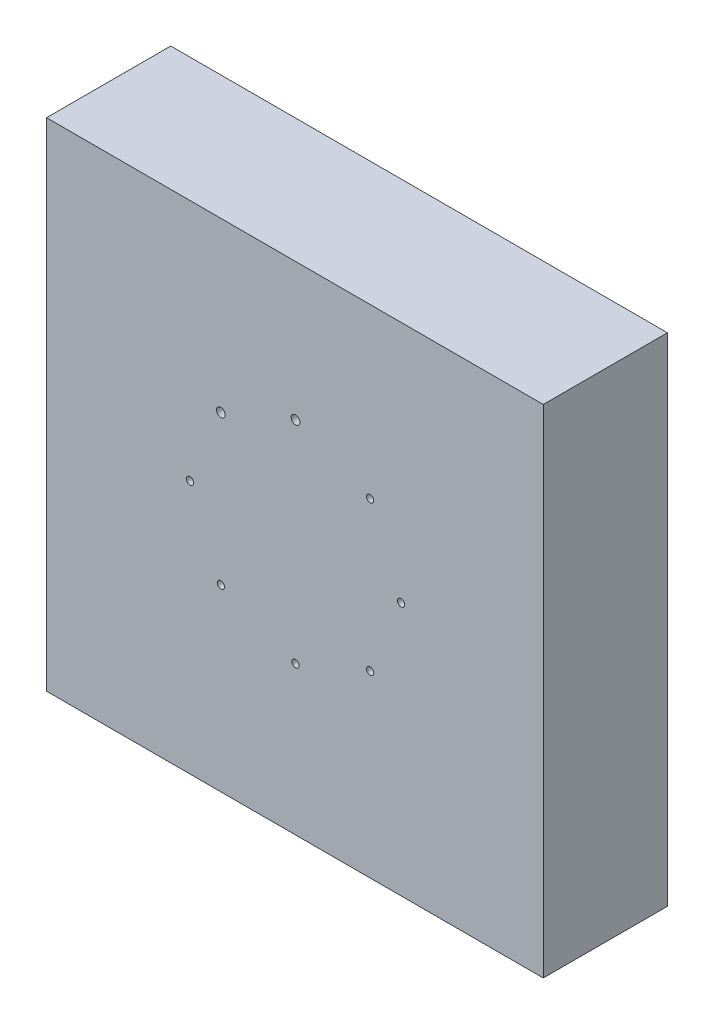
ISO-10303-21;
HEADER;
FILE_DESCRIPTION(('STEP AP214'),'2;1');
FILE_NAME('part.step','',(''),(''),'','','');
FILE_SCHEMA(('AUTOMOTIVE_DESIGN { 1 0 10303 214 1 1 1 1 }'));
ENDSEC;
DATA;
#1=APPLICATION_CONTEXT('core data for automotive mechanical design processes');
#2=APPLICATION_PROTOCOL_DEFINITION('international standard','automotive_design',2000,#1);
#3=PRODUCT_CONTEXT('',#1,'mechanical');
#4=PRODUCT('Part','Part','',(#3));
#5=PRODUCT_RELATED_PRODUCT_CATEGORY('part','',(#4));
#6=PRODUCT_DEFINITION_FORMATION('','',#4);
#7=PRODUCT_DEFINITION_CONTEXT('part definition',#1,'design');
#8=PRODUCT_DEFINITION('design','',#6,#7);
#9=PRODUCT_DEFINITION_SHAPE('','',#8);
#10=(LENGTH_UNIT() NAMED_UNIT(*) SI_UNIT(.MILLI.,.METRE.));
#11=(NAMED_UNIT(*) PLANE_ANGLE_UNIT() SI_UNIT($,.RADIAN.));
#12=(NAMED_UNIT(*) SI_UNIT($,.STERADIAN.) SOLID_ANGLE_UNIT());
#13=UNCERTAINTY_MEASURE_WITH_UNIT(LENGTH_MEASURE(1.E-05),#10,'distance_accuracy_value','');
#14=(GEOMETRIC_REPRESENTATION_CONTEXT(3) GLOBAL_UNCERTAINTY_ASSIGNED_CONTEXT((#13)) GLOBAL_UNIT_ASSIGNED_CONTEXT((#10,
#11,#12)) REPRESENTATION_CONTEXT('',''));
#15=CARTESIAN_POINT('',(0.,0.,0.));
#16=DIRECTION('',(0.,0.,1.));
#17=DIRECTION('',(1.,0.,0.));
#18=AXIS2_PLACEMENT_3D('',#15,#16,#17);
#19=CARTESIAN_POINT('',(100.,-100.,50.));
#20=DIRECTION('',(-1.,0.,0.));
#21=DIRECTION('',(0.,0.,1.));
#22=AXIS2_PLACEMENT_3D('',#19,#20,#21);
#23=PLANE('',#22);
#24=DIRECTION('',(0.,1.,0.));
#25=VECTOR('',#24,1.);
#26=CARTESIAN_POINT('',(100.,-100.,0.));
#27=LINE('',#26,#25);
#28=CARTESIAN_POINT('',(100.,-100.,0.));
#29=VERTEX_POINT('',#28);
#30=CARTESIAN_POINT('',(100.,100.,0.));
#31=VERTEX_POINT('',#30);
#32=EDGE_CURVE('E113',#29,#31,#27,.T.);
#33=ORIENTED_EDGE('',*,*,#32,.T.);
#34=DIRECTION('',(0.,0.,-1.));
#35=VECTOR('',#34,1.);
#36=CARTESIAN_POINT('',(100.,100.,50.));
#37=LINE('',#36,#35);
#38=CARTESIAN_POINT('',(100.,100.,50.));
#39=VERTEX_POINT('',#38);
#40=EDGE_CURVE('E12',#39,#31,#37,.T.);
#41=ORIENTED_EDGE('',*,*,#40,.F.);
#42=DIRECTION('',(0.,1.,0.));
#43=VECTOR('',#42,1.);
#44=CARTESIAN_POINT('',(100.,-100.,50.));
#45=LINE('',#44,#43);
#46=CARTESIAN_POINT('',(100.,-100.,50.));
#47=VERTEX_POINT('',#46);
#48=EDGE_CURVE('E101',#47,#39,#45,.T.);
#49=ORIENTED_EDGE('',*,*,#48,.F.);
#50=DIRECTION('',(0.,0.,-1.));
#51=VECTOR('',#50,1.);
#52=CARTESIAN_POINT('',(100.,-100.,50.));
#53=LINE('',#52,#51);
#54=EDGE_CURVE('E109',#47,#29,#53,.T.);
#55=ORIENTED_EDGE('',*,*,#54,.T.);
#56=EDGE_LOOP('',(#33,#41,#49,#55));
#57=FACE_BOUND('',#56,.T.);
#58=ADVANCED_FACE('F50',(#57),#23,.F.);
#59=CARTESIAN_POINT('',(-100.,100.,50.));
#60=DIRECTION('',(0.,-1.,0.));
#61=DIRECTION('',(0.,0.,-1.));
#62=AXIS2_PLACEMENT_3D('',#59,#60,#61);
#63=PLANE('',#62);
#64=DIRECTION('',(-1.,0.,0.));
#65=VECTOR('',#64,1.);
#66=CARTESIAN_POINT('',(-100.,100.,0.));
#67=LINE('',#66,#65);
#68=CARTESIAN_POINT('',(-100.,100.,0.));
#69=VERTEX_POINT('',#68);
#70=EDGE_CURVE('E105',#31,#69,#67,.T.);
#71=ORIENTED_EDGE('',*,*,#70,.T.);
#72=DIRECTION('',(0.,0.,-1.));
#73=VECTOR('',#72,1.);
#74=CARTESIAN_POINT('',(-100.,100.,50.));
#75=LINE('',#74,#73);
#76=CARTESIAN_POINT('',(-100.,100.,50.));
#77=VERTEX_POINT('',#76);
#78=EDGE_CURVE('E58',#77,#69,#75,.T.);
#79=ORIENTED_EDGE('',*,*,#78,.F.);
#80=DIRECTION('',(-1.,0.,0.));
#81=VECTOR('',#80,1.);
#82=CARTESIAN_POINT('',(-100.,100.,50.));
#83=LINE('',#82,#81);
#84=EDGE_CURVE('E96',#39,#77,#83,.T.);
#85=ORIENTED_EDGE('',*,*,#84,.F.);
#86=ORIENTED_EDGE('',*,*,#40,.T.);
#87=EDGE_LOOP('',(#71,#79,#85,#86));
#88=FACE_BOUND('',#87,.T.);
#89=ADVANCED_FACE('F104',(#88),#63,.F.);
#90=CARTESIAN_POINT('',(-100.,-100.,50.));
#91=DIRECTION('',(1.,0.,0.));
#92=DIRECTION('',(0.,0.,-1.));
#93=AXIS2_PLACEMENT_3D('',#90,#91,#92);
#94=PLANE('',#93);
#95=DIRECTION('',(0.,-1.,0.));
#96=VECTOR('',#95,1.);
#97=CARTESIAN_POINT('',(-100.,-100.,0.));
#98=LINE('',#97,#96);
#99=CARTESIAN_POINT('',(-100.,-100.,0.));
#100=VERTEX_POINT('',#99);
#101=EDGE_CURVE('E83',#69,#100,#98,.T.);
#102=ORIENTED_EDGE('',*,*,#101,.T.);
#103=DIRECTION('',(0.,0.,-1.));
#104=VECTOR('',#103,1.);
#105=CARTESIAN_POINT('',(-100.,-100.,50.));
#106=LINE('',#105,#104);
#107=CARTESIAN_POINT('',(-100.,-100.,50.));
#108=VERTEX_POINT('',#107);
#109=EDGE_CURVE('E106',#108,#100,#106,.T.);
#110=ORIENTED_EDGE('',*,*,#109,.F.);
#111=DIRECTION('',(0.,-1.,0.));
#112=VECTOR('',#111,1.);
#113=CARTESIAN_POINT('',(-100.,-100.,50.));
#114=LINE('',#113,#112);
#115=EDGE_CURVE('E99',#77,#108,#114,.T.);
#116=ORIENTED_EDGE('',*,*,#115,.F.);
#117=ORIENTED_EDGE('',*,*,#78,.T.);
#118=EDGE_LOOP('',(#102,#110,#116,#117));
#119=FACE_BOUND('',#118,.T.);
#120=ADVANCED_FACE('F107',(#119),#94,.F.);
#121=CARTESIAN_POINT('',(-100.,-100.,50.));
#122=DIRECTION('',(0.,1.,0.));
#123=DIRECTION('',(0.,0.,1.));
#124=AXIS2_PLACEMENT_3D('',#121,#122,#123);
#125=PLANE('',#124);
#126=DIRECTION('',(1.,0.,0.));
#127=VECTOR('',#126,1.);
#128=CARTESIAN_POINT('',(-100.,-100.,0.));
#129=LINE('',#128,#127);
#130=EDGE_CURVE('E89',#100,#29,#129,.T.);
#131=ORIENTED_EDGE('',*,*,#130,.T.);
#132=ORIENTED_EDGE('',*,*,#54,.F.);
#133=DIRECTION('',(1.,0.,0.));
#134=VECTOR('',#133,1.);
#135=CARTESIAN_POINT('',(-100.,-100.,50.));
#136=LINE('',#135,#134);
#137=EDGE_CURVE('E66',#108,#47,#136,.T.);
#138=ORIENTED_EDGE('',*,*,#137,.F.);
#139=ORIENTED_EDGE('',*,*,#109,.T.);
#140=EDGE_LOOP('',(#131,#132,#138,#139));
#141=FACE_BOUND('',#140,.T.);
#142=ADVANCED_FACE('F121',(#141),#125,.F.);
#143=CARTESIAN_POINT('',(0.,0.,50.));
#144=DIRECTION('',(0.,0.,-1.));
#145=DIRECTION('',(-1.,0.,0.));
#146=AXIS2_PLACEMENT_3D('',#143,#144,#145);
#147=PLANE('',#146);
#148=CARTESIAN_POINT('',(0.2500000000469,-40.2500000000434,50.));
#149=DIRECTION('',(0.,0.,1.));
#150=DIRECTION('',(1.,0.,0.));
#151=AXIS2_PLACEMENT_3D('',#148,#149,#150);
#152=CIRCLE('',#151,1.45000000000055);
#153=CARTESIAN_POINT('',(1.70000000004745,-40.2500000000434,50.));
#154=VERTEX_POINT('',#153);
#155=EDGE_CURVE('E140',#154,#154,#152,.T.);
#156=ORIENTED_EDGE('',*,*,#155,.F.);
#157=EDGE_LOOP('',(#156));
#158=FACE_BOUND('',#157,.T.);
#159=CARTESIAN_POINT('',(0.250543486024143,44.7499999982499,50.));
#160=DIRECTION('',(0.,0.,1.));
#161=DIRECTION('',(1.,0.,0.));
#162=AXIS2_PLACEMENT_3D('',#159,#160,#161);
#163=CIRCLE('',#162,1.75054348597008);
#164=CARTESIAN_POINT('',(2.00108697199422,44.7499999982499,50.));
#165=VERTEX_POINT('',#164);
#166=EDGE_CURVE('E156',#165,#165,#163,.T.);
#167=ORIENTED_EDGE('',*,*,#166,.F.);
#168=EDGE_LOOP('',(#167));
#169=FACE_BOUND('',#168,.T.);
#170=CARTESIAN_POINT('',(30.3020382005077,32.3020382004647,50.));
#171=DIRECTION('',(0.,0.,1.));
#172=DIRECTION('',(1.,0.,0.));
#173=AXIS2_PLACEMENT_3D('',#170,#171,#172);
#174=CIRCLE('',#173,1.43937026376093);
#175=CARTESIAN_POINT('',(31.7414084642686,32.3020382004647,50.));
#176=VERTEX_POINT('',#175);
#177=EDGE_CURVE('E162',#176,#176,#174,.T.);
#178=ORIENTED_EDGE('',*,*,#177,.F.);
#179=EDGE_LOOP('',(#178));
#180=FACE_BOUND('',#179,.T.);
#181=CARTESIAN_POINT('',(30.3021177915458,-27.8022303520025,50.));
#182=DIRECTION('',(0.,0.,1.));
#183=DIRECTION('',(1.,0.,0.));
#184=AXIS2_PLACEMENT_3D('',#181,#182,#183);
#185=CIRCLE('',#184,1.44999999999983);
#186=CARTESIAN_POINT('',(31.7521177915456,-27.8022303520025,50.));
#187=VERTEX_POINT('',#186);
#188=EDGE_CURVE('E145',#187,#187,#185,.T.);
#189=ORIENTED_EDGE('',*,*,#188,.F.);
#190=EDGE_LOOP('',(#189));
#191=FACE_BOUND('',#190,.T.);
#192=CARTESIAN_POINT('',(-29.8020382004144,-27.8020382004581,50.));
#193=DIRECTION('',(0.,0.,1.));
#194=DIRECTION('',(1.,0.,0.));
#195=AXIS2_PLACEMENT_3D('',#192,#193,#194);
#196=CIRCLE('',#195,1.45014707417167);
#197=CARTESIAN_POINT('',(-28.3518911262428,-27.8020382004581,50.));
#198=VERTEX_POINT('',#197);
#199=EDGE_CURVE('E137',#198,#198,#196,.T.);
#200=ORIENTED_EDGE('',*,*,#199,.F.);
#201=EDGE_LOOP('',(#200));
#202=FACE_BOUND('',#201,.T.);
#203=CARTESIAN_POINT('',(-42.2499999999999,2.25000000000322,50.));
#204=DIRECTION('',(0.,0.,1.));
#205=DIRECTION('',(1.,0.,0.));
#206=AXIS2_PLACEMENT_3D('',#203,#204,#205);
#207=CIRCLE('',#206,1.44961569738909);
#208=CARTESIAN_POINT('',(-40.8003843026108,2.25000000000322,50.));
#209=VERTEX_POINT('',#208);
#210=EDGE_CURVE('E130',#209,#209,#207,.T.);
#211=ORIENTED_EDGE('',*,*,#210,.F.);
#212=EDGE_LOOP('',(#211));
#213=FACE_BOUND('',#212,.T.);
#214=CARTESIAN_POINT('',(-29.8020382004149,32.3020382004641,50.));
#215=DIRECTION('',(0.,0.,1.));
#216=DIRECTION('',(1.,0.,0.));
#217=AXIS2_PLACEMENT_3D('',#214,#215,#216);
#218=CIRCLE('',#217,1.75);
#219=CARTESIAN_POINT('',(-28.0520382004149,32.3020382004641,50.));
#220=VERTEX_POINT('',#219);
#221=EDGE_CURVE('E131',#220,#220,#218,.T.);
#222=ORIENTED_EDGE('',*,*,#221,.F.);
#223=EDGE_LOOP('',(#222));
#224=FACE_BOUND('',#223,.T.);
#225=CARTESIAN_POINT('',(42.7502717421707,2.24972825613381,50.));
#226=DIRECTION('',(0.,0.,1.));
#227=DIRECTION('',(1.,0.,0.));
#228=AXIS2_PLACEMENT_3D('',#225,#226,#227);
#229=CIRCLE('',#228,1.45000000000027);
#230=CARTESIAN_POINT('',(44.200271742171,2.24972825613381,50.));
#231=VERTEX_POINT('',#230);
#232=EDGE_CURVE('E144',#231,#231,#229,.T.);
#233=ORIENTED_EDGE('',*,*,#232,.F.);
#234=EDGE_LOOP('',(#233));
#235=FACE_BOUND('',#234,.T.);
#236=ORIENTED_EDGE('',*,*,#48,.T.);
#237=ORIENTED_EDGE('',*,*,#84,.T.);
#238=ORIENTED_EDGE('',*,*,#115,.T.);
#239=ORIENTED_EDGE('',*,*,#137,.T.);
#240=EDGE_LOOP('',(#236,#237,#238,#239));
#241=FACE_BOUND('',#240,.T.);
#242=ADVANCED_FACE('F97',(#158,#169,#180,#191,#202,#213,#224,#235,#241),#147,.F.);
#243=CARTESIAN_POINT('',(0.,0.,0.));
#244=DIRECTION('',(0.,0.,-1.));
#245=DIRECTION('',(-1.,0.,0.));
#246=AXIS2_PLACEMENT_3D('',#243,#244,#245);
#247=PLANE('',#246);
#248=ORIENTED_EDGE('',*,*,#32,.F.);
#249=ORIENTED_EDGE('',*,*,#130,.F.);
#250=ORIENTED_EDGE('',*,*,#101,.F.);
#251=ORIENTED_EDGE('',*,*,#70,.F.);
#252=EDGE_LOOP('',(#248,#249,#250,#251));
#253=FACE_BOUND('',#252,.T.);
#254=ADVANCED_FACE('F124',(#253),#247,.T.);
#255=CARTESIAN_POINT('',(42.7502717421707,2.24972825613381,45.));
#256=DIRECTION('',(0.,0.,1.));
#257=DIRECTION('',(1.,0.,0.));
#258=AXIS2_PLACEMENT_3D('',#255,#256,#257);
#259=CYLINDRICAL_SURFACE('',#258,1.45000000000027);
#260=CARTESIAN_POINT('',(42.7502717421707,2.24972825613381,45.));
#261=DIRECTION('',(0.,0.,1.));
#262=DIRECTION('',(1.,0.,0.));
#263=AXIS2_PLACEMENT_3D('',#260,#261,#262);
#264=CIRCLE('',#263,1.45000000000027);
#265=CARTESIAN_POINT('',(44.200271742171,2.24972825613381,45.));
#266=VERTEX_POINT('',#265);
#267=EDGE_CURVE('E141',#266,#266,#264,.T.);
#268=ORIENTED_EDGE('',*,*,#267,.F.);
#269=EDGE_LOOP('',(#268));
#270=FACE_BOUND('',#269,.T.);
#271=ORIENTED_EDGE('',*,*,#232,.T.);
#272=EDGE_LOOP('',(#271));
#273=FACE_BOUND('',#272,.T.);
#274=ADVANCED_FACE('F201',(#270,#273),#259,.F.);
#275=CARTESIAN_POINT('',(0.,0.,45.));
#276=DIRECTION('',(0.,0.,1.));
#277=DIRECTION('',(1.,0.,0.));
#278=AXIS2_PLACEMENT_3D('',#275,#276,#277);
#279=PLANE('',#278);
#280=ORIENTED_EDGE('',*,*,#267,.T.);
#281=EDGE_LOOP('',(#280));
#282=FACE_BOUND('',#281,.T.);
#283=ADVANCED_FACE('F203',(#282),#279,.T.);
#284=CARTESIAN_POINT('',(-29.8020382004149,32.3020382004641,45.));
#285=DIRECTION('',(0.,0.,1.));
#286=DIRECTION('',(1.,0.,0.));
#287=AXIS2_PLACEMENT_3D('',#284,#285,#286);
#288=CYLINDRICAL_SURFACE('',#287,1.75);
#289=CARTESIAN_POINT('',(-29.8020382004149,32.3020382004641,45.));
#290=DIRECTION('',(0.,0.,1.));
#291=DIRECTION('',(1.,0.,0.));
#292=AXIS2_PLACEMENT_3D('',#289,#290,#291);
#293=CIRCLE('',#292,1.75);
#294=CARTESIAN_POINT('',(-28.0520382004149,32.3020382004641,45.));
#295=VERTEX_POINT('',#294);
#296=EDGE_CURVE('E148',#295,#295,#293,.T.);
#297=ORIENTED_EDGE('',*,*,#296,.F.);
#298=EDGE_LOOP('',(#297));
#299=FACE_BOUND('',#298,.T.);
#300=ORIENTED_EDGE('',*,*,#221,.T.);
#301=EDGE_LOOP('',(#300));
#302=FACE_BOUND('',#301,.T.);
#303=ADVANCED_FACE('F210',(#299,#302),#288,.F.);
#304=CARTESIAN_POINT('',(0.,0.,45.));
#305=DIRECTION('',(0.,0.,1.));
#306=DIRECTION('',(1.,0.,0.));
#307=AXIS2_PLACEMENT_3D('',#304,#305,#306);
#308=PLANE('',#307);
#309=ORIENTED_EDGE('',*,*,#296,.T.);
#310=EDGE_LOOP('',(#309));
#311=FACE_BOUND('',#310,.T.);
#312=ADVANCED_FACE('F235',(#311),#308,.T.);
#313=CARTESIAN_POINT('',(-42.2499999999999,2.25000000000322,45.));
#314=DIRECTION('',(0.,0.,1.));
#315=DIRECTION('',(1.,0.,0.));
#316=AXIS2_PLACEMENT_3D('',#313,#314,#315);
#317=CYLINDRICAL_SURFACE('',#316,1.44961569738909);
#318=CARTESIAN_POINT('',(-42.2499999999999,2.25000000000322,45.));
#319=DIRECTION('',(0.,0.,1.));
#320=DIRECTION('',(1.,0.,0.));
#321=AXIS2_PLACEMENT_3D('',#318,#319,#320);
#322=CIRCLE('',#321,1.44961569738909);
#323=CARTESIAN_POINT('',(-40.8003843026108,2.25000000000322,45.));
#324=VERTEX_POINT('',#323);
#325=EDGE_CURVE('E127',#324,#324,#322,.T.);
#326=ORIENTED_EDGE('',*,*,#325,.F.);
#327=EDGE_LOOP('',(#326));
#328=FACE_BOUND('',#327,.T.);
#329=ORIENTED_EDGE('',*,*,#210,.T.);
#330=EDGE_LOOP('',(#329));
#331=FACE_BOUND('',#330,.T.);
#332=ADVANCED_FACE('F231',(#328,#331),#317,.F.);
#333=CARTESIAN_POINT('',(0.,0.,45.));
#334=DIRECTION('',(0.,0.,1.));
#335=DIRECTION('',(1.,0.,0.));
#336=AXIS2_PLACEMENT_3D('',#333,#334,#335);
#337=PLANE('',#336);
#338=ORIENTED_EDGE('',*,*,#325,.T.);
#339=EDGE_LOOP('',(#338));
#340=FACE_BOUND('',#339,.T.);
#341=ADVANCED_FACE('F227',(#340),#337,.T.);
#342=CARTESIAN_POINT('',(-29.8020382004144,-27.8020382004581,45.));
#343=DIRECTION('',(0.,0.,1.));
#344=DIRECTION('',(1.,0.,0.));
#345=AXIS2_PLACEMENT_3D('',#342,#343,#344);
#346=CYLINDRICAL_SURFACE('',#345,1.45014707417167);
#347=CARTESIAN_POINT('',(-29.8020382004144,-27.8020382004581,45.));
#348=DIRECTION('',(0.,0.,1.));
#349=DIRECTION('',(1.,0.,0.));
#350=AXIS2_PLACEMENT_3D('',#347,#348,#349);
#351=CIRCLE('',#350,1.45014707417167);
#352=CARTESIAN_POINT('',(-28.3518911262428,-27.8020382004581,45.));
#353=VERTEX_POINT('',#352);
#354=EDGE_CURVE('E134',#353,#353,#351,.T.);
#355=ORIENTED_EDGE('',*,*,#354,.F.);
#356=EDGE_LOOP('',(#355));
#357=FACE_BOUND('',#356,.T.);
#358=ORIENTED_EDGE('',*,*,#199,.T.);
#359=EDGE_LOOP('',(#358));
#360=FACE_BOUND('',#359,.T.);
#361=ADVANCED_FACE('F230',(#357,#360),#346,.F.);
#362=CARTESIAN_POINT('',(0.,0.,45.));
#363=DIRECTION('',(0.,0.,1.));
#364=DIRECTION('',(1.,0.,0.));
#365=AXIS2_PLACEMENT_3D('',#362,#363,#364);
#366=PLANE('',#365);
#367=ORIENTED_EDGE('',*,*,#354,.T.);
#368=EDGE_LOOP('',(#367));
#369=FACE_BOUND('',#368,.T.);
#370=ADVANCED_FACE('F237',(#369),#366,.T.);
#371=CARTESIAN_POINT('',(30.3021177915458,-27.8022303520025,45.));
#372=DIRECTION('',(0.,0.,1.));
#373=DIRECTION('',(1.,0.,0.));
#374=AXIS2_PLACEMENT_3D('',#371,#372,#373);
#375=CYLINDRICAL_SURFACE('',#374,1.44999999999983);
#376=CARTESIAN_POINT('',(30.3021177915458,-27.8022303520025,45.));
#377=DIRECTION('',(0.,0.,1.));
#378=DIRECTION('',(1.,0.,0.));
#379=AXIS2_PLACEMENT_3D('',#376,#377,#378);
#380=CIRCLE('',#379,1.44999999999983);
#381=CARTESIAN_POINT('',(31.7521177915456,-27.8022303520025,45.));
#382=VERTEX_POINT('',#381);
#383=EDGE_CURVE('E165',#382,#382,#380,.T.);
#384=ORIENTED_EDGE('',*,*,#383,.F.);
#385=EDGE_LOOP('',(#384));
#386=FACE_BOUND('',#385,.T.);
#387=ORIENTED_EDGE('',*,*,#188,.T.);
#388=EDGE_LOOP('',(#387));
#389=FACE_BOUND('',#388,.T.);
#390=ADVANCED_FACE('F240',(#386,#389),#375,.F.);
#391=CARTESIAN_POINT('',(0.,0.,45.));
#392=DIRECTION('',(0.,0.,1.));
#393=DIRECTION('',(1.,0.,0.));
#394=AXIS2_PLACEMENT_3D('',#391,#392,#393);
#395=PLANE('',#394);
#396=ORIENTED_EDGE('',*,*,#383,.T.);
#397=EDGE_LOOP('',(#396));
#398=FACE_BOUND('',#397,.T.);
#399=ADVANCED_FACE('F260',(#398),#395,.T.);
#400=CARTESIAN_POINT('',(30.3020382005077,32.3020382004647,45.));
#401=DIRECTION('',(0.,0.,1.));
#402=DIRECTION('',(1.,0.,0.));
#403=AXIS2_PLACEMENT_3D('',#400,#401,#402);
#404=CYLINDRICAL_SURFACE('',#403,1.43937026376093);
#405=CARTESIAN_POINT('',(30.3020382005077,32.3020382004647,45.));
#406=DIRECTION('',(0.,0.,1.));
#407=DIRECTION('',(1.,0.,0.));
#408=AXIS2_PLACEMENT_3D('',#405,#406,#407);
#409=CIRCLE('',#408,1.43937026376093);
#410=CARTESIAN_POINT('',(31.7414084642686,32.3020382004647,45.));
#411=VERTEX_POINT('',#410);
#412=EDGE_CURVE('E159',#411,#411,#409,.T.);
#413=ORIENTED_EDGE('',*,*,#412,.F.);
#414=EDGE_LOOP('',(#413));
#415=FACE_BOUND('',#414,.T.);
#416=ORIENTED_EDGE('',*,*,#177,.T.);
#417=EDGE_LOOP('',(#416));
#418=FACE_BOUND('',#417,.T.);
#419=ADVANCED_FACE('F268',(#415,#418),#404,.F.);
#420=CARTESIAN_POINT('',(0.,0.,45.));
#421=DIRECTION('',(0.,0.,1.));
#422=DIRECTION('',(1.,0.,0.));
#423=AXIS2_PLACEMENT_3D('',#420,#421,#422);
#424=PLANE('',#423);
#425=ORIENTED_EDGE('',*,*,#412,.T.);
#426=EDGE_LOOP('',(#425));
#427=FACE_BOUND('',#426,.T.);
#428=ADVANCED_FACE('F276',(#427),#424,.T.);
#429=CARTESIAN_POINT('',(0.250543486024143,44.7499999982499,45.));
#430=DIRECTION('',(0.,0.,1.));
#431=DIRECTION('',(1.,0.,0.));
#432=AXIS2_PLACEMENT_3D('',#429,#430,#431);
#433=CYLINDRICAL_SURFACE('',#432,1.75054348597008);
#434=CARTESIAN_POINT('',(0.250543486024143,44.7499999982499,45.));
#435=DIRECTION('',(0.,0.,1.));
#436=DIRECTION('',(1.,0.,0.));
#437=AXIS2_PLACEMENT_3D('',#434,#435,#436);
#438=CIRCLE('',#437,1.75054348597008);
#439=CARTESIAN_POINT('',(2.00108697199422,44.7499999982499,45.));
#440=VERTEX_POINT('',#439);
#441=EDGE_CURVE('E153',#440,#440,#438,.T.);
#442=ORIENTED_EDGE('',*,*,#441,.F.);
#443=EDGE_LOOP('',(#442));
#444=FACE_BOUND('',#443,.T.);
#445=ORIENTED_EDGE('',*,*,#166,.T.);
#446=EDGE_LOOP('',(#445));
#447=FACE_BOUND('',#446,.T.);
#448=ADVANCED_FACE('F284',(#444,#447),#433,.F.);
#449=CARTESIAN_POINT('',(0.,0.,45.));
#450=DIRECTION('',(0.,0.,1.));
#451=DIRECTION('',(1.,0.,0.));
#452=AXIS2_PLACEMENT_3D('',#449,#450,#451);
#453=PLANE('',#452);
#454=ORIENTED_EDGE('',*,*,#441,.T.);
#455=EDGE_LOOP('',(#454));
#456=FACE_BOUND('',#455,.T.);
#457=ADVANCED_FACE('F180',(#456),#453,.T.);
#458=CARTESIAN_POINT('',(0.2500000000469,-40.2500000000434,45.));
#459=DIRECTION('',(0.,0.,1.));
#460=DIRECTION('',(1.,0.,0.));
#461=AXIS2_PLACEMENT_3D('',#458,#459,#460);
#462=CYLINDRICAL_SURFACE('',#461,1.45000000000055);
#463=CARTESIAN_POINT('',(0.2500000000469,-40.2500000000434,45.));
#464=DIRECTION('',(0.,0.,1.));
#465=DIRECTION('',(1.,0.,0.));
#466=AXIS2_PLACEMENT_3D('',#463,#464,#465);
#467=CIRCLE('',#466,1.45000000000055);
#468=CARTESIAN_POINT('',(1.70000000004745,-40.2500000000434,45.));
#469=VERTEX_POINT('',#468);
#470=EDGE_CURVE('E116',#469,#469,#467,.T.);
#471=ORIENTED_EDGE('',*,*,#470,.F.);
#472=EDGE_LOOP('',(#471));
#473=FACE_BOUND('',#472,.T.);
#474=ORIENTED_EDGE('',*,*,#155,.T.);
#475=EDGE_LOOP('',(#474));
#476=FACE_BOUND('',#475,.T.);
#477=ADVANCED_FACE('F177',(#473,#476),#462,.F.);
#478=CARTESIAN_POINT('',(0.,0.,45.));
#479=DIRECTION('',(0.,0.,1.));
#480=DIRECTION('',(1.,0.,0.));
#481=AXIS2_PLACEMENT_3D('',#478,#479,#480);
#482=PLANE('',#481);
#483=ORIENTED_EDGE('',*,*,#470,.T.);
#484=EDGE_LOOP('',(#483));
#485=FACE_BOUND('',#484,.T.);
#486=ADVANCED_FACE('F175',(#485),#482,.T.);
#487=CLOSED_SHELL('',(#58,#89,#120,#142,#242,#254,#274,#283,#303,#312,#332,#341,#361,#370,#390,
#399,#419,#428,#448,#457,#477,#486));
#488=MANIFOLD_SOLID_BREP('B2',#487);
#489=ADVANCED_BREP_SHAPE_REPRESENTATION('',(#18,#488),#14);
#490=SHAPE_DEFINITION_REPRESENTATION(#9,#489);
ENDSEC;
END-ISO-10303-21;
